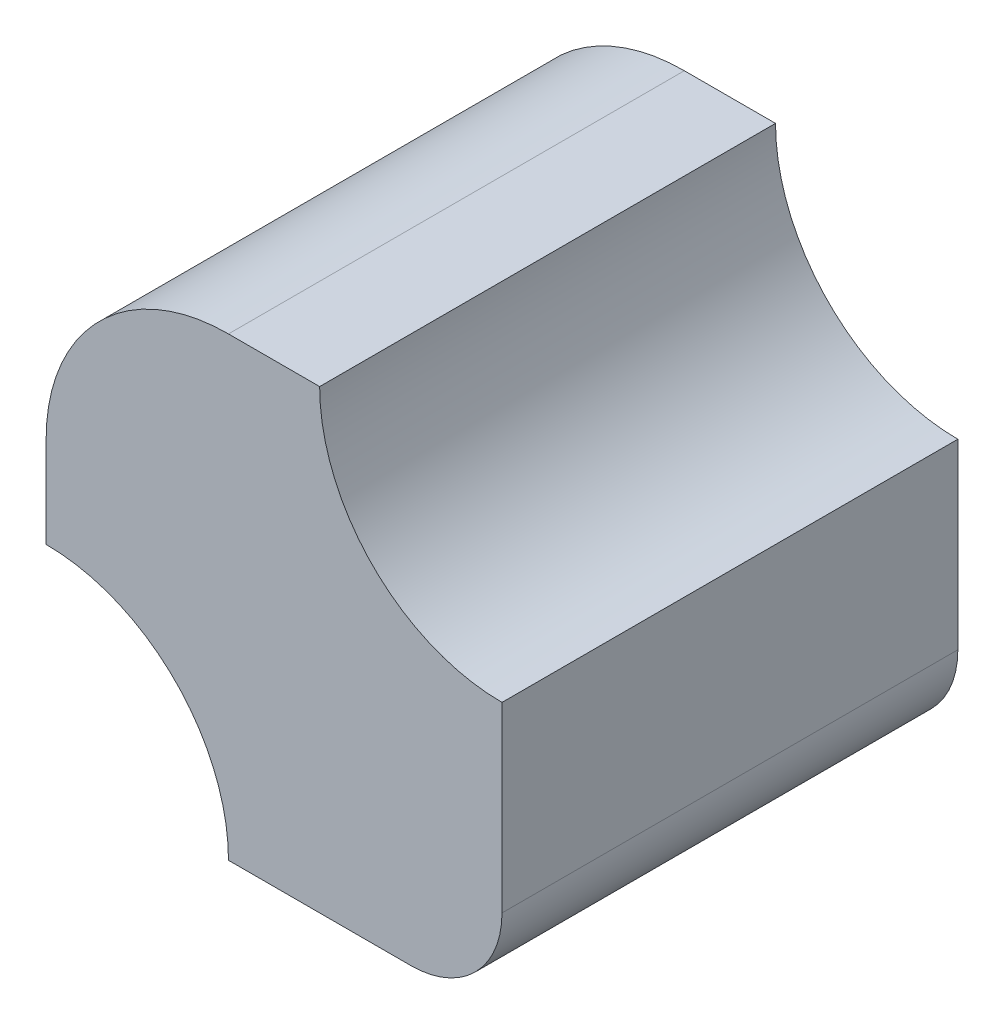
ISO-10303-21;
HEADER;
FILE_DESCRIPTION(('STEP AP214'),'2;1');
FILE_NAME('part.step','',(''),(''),'','','');
FILE_SCHEMA(('AUTOMOTIVE_DESIGN { 1 0 10303 214 1 1 1 1 }'));
ENDSEC;
DATA;
#1=APPLICATION_CONTEXT('core data for automotive mechanical design processes');
#2=APPLICATION_PROTOCOL_DEFINITION('international standard','automotive_design',2000,#1);
#3=PRODUCT_CONTEXT('',#1,'mechanical');
#4=PRODUCT('Part','Part','',(#3));
#5=PRODUCT_RELATED_PRODUCT_CATEGORY('part','',(#4));
#6=PRODUCT_DEFINITION_FORMATION('','',#4);
#7=PRODUCT_DEFINITION_CONTEXT('part definition',#1,'design');
#8=PRODUCT_DEFINITION('design','',#6,#7);
#9=PRODUCT_DEFINITION_SHAPE('','',#8);
#10=(LENGTH_UNIT() NAMED_UNIT(*) SI_UNIT(.MILLI.,.METRE.));
#11=(NAMED_UNIT(*) PLANE_ANGLE_UNIT() SI_UNIT($,.RADIAN.));
#12=(NAMED_UNIT(*) SI_UNIT($,.STERADIAN.) SOLID_ANGLE_UNIT());
#13=UNCERTAINTY_MEASURE_WITH_UNIT(LENGTH_MEASURE(1.E-05),#10,'distance_accuracy_value','');
#14=(GEOMETRIC_REPRESENTATION_CONTEXT(3) GLOBAL_UNCERTAINTY_ASSIGNED_CONTEXT((#13)) GLOBAL_UNIT_ASSIGNED_CONTEXT((#10,
#11,#12)) REPRESENTATION_CONTEXT('',''));
#15=CARTESIAN_POINT('',(0.,0.,0.));
#16=DIRECTION('',(0.,0.,1.));
#17=DIRECTION('',(1.,0.,0.));
#18=AXIS2_PLACEMENT_3D('',#15,#16,#17);
#19=CARTESIAN_POINT('',(-15.,10.,25.));
#20=DIRECTION('',(0.,0.,-1.));
#21=DIRECTION('',(-1.,0.,0.));
#22=AXIS2_PLACEMENT_3D('',#19,#20,#21);
#23=CYLINDRICAL_SURFACE('',#22,10.);
#24=CARTESIAN_POINT('',(-15.,10.,0.));
#25=DIRECTION('',(0.,0.,1.));
#26=DIRECTION('',(-1.,0.,0.));
#27=AXIS2_PLACEMENT_3D('',#24,#25,#26);
#28=CIRCLE('',#27,10.);
#29=CARTESIAN_POINT('',(-15.,20.,0.));
#30=VERTEX_POINT('',#29);
#31=CARTESIAN_POINT('',(-25.,10.,0.));
#32=VERTEX_POINT('',#31);
#33=EDGE_CURVE('E129',#30,#32,#28,.T.);
#34=ORIENTED_EDGE('',*,*,#33,.T.);
#35=DIRECTION('',(0.,0.,-1.));
#36=VECTOR('',#35,1.);
#37=CARTESIAN_POINT('',(-25.,10.,25.));
#38=LINE('',#37,#36);
#39=CARTESIAN_POINT('',(-25.,10.,25.));
#40=VERTEX_POINT('',#39);
#41=EDGE_CURVE('E11',#40,#32,#38,.T.);
#42=ORIENTED_EDGE('',*,*,#41,.F.);
#43=CARTESIAN_POINT('',(-15.,10.,25.));
#44=DIRECTION('',(0.,0.,1.));
#45=DIRECTION('',(-1.,0.,0.));
#46=AXIS2_PLACEMENT_3D('',#43,#44,#45);
#47=CIRCLE('',#46,10.);
#48=CARTESIAN_POINT('',(-15.,20.,25.));
#49=VERTEX_POINT('',#48);
#50=EDGE_CURVE('E143',#49,#40,#47,.T.);
#51=ORIENTED_EDGE('',*,*,#50,.F.);
#52=DIRECTION('',(0.,0.,-1.));
#53=VECTOR('',#52,1.);
#54=CARTESIAN_POINT('',(-15.,20.,25.));
#55=LINE('',#54,#53);
#56=EDGE_CURVE('E125',#49,#30,#55,.T.);
#57=ORIENTED_EDGE('',*,*,#56,.T.);
#58=EDGE_LOOP('',(#34,#42,#51,#57));
#59=FACE_BOUND('',#58,.T.);
#60=ADVANCED_FACE('F33',(#59),#23,.T.);
#61=CARTESIAN_POINT('',(-25.,5.,25.));
#62=DIRECTION('',(1.,0.,0.));
#63=DIRECTION('',(0.,0.,-1.));
#64=AXIS2_PLACEMENT_3D('',#61,#62,#63);
#65=PLANE('',#64);
#66=DIRECTION('',(0.,-1.,0.));
#67=VECTOR('',#66,1.);
#68=CARTESIAN_POINT('',(-25.,5.,0.));
#69=LINE('',#68,#67);
#70=CARTESIAN_POINT('',(-25.,5.,0.));
#71=VERTEX_POINT('',#70);
#72=EDGE_CURVE('E132',#32,#71,#69,.T.);
#73=ORIENTED_EDGE('',*,*,#72,.T.);
#74=DIRECTION('',(0.,0.,-1.));
#75=VECTOR('',#74,1.);
#76=CARTESIAN_POINT('',(-25.,5.,25.));
#77=LINE('',#76,#75);
#78=CARTESIAN_POINT('',(-25.,5.,25.));
#79=VERTEX_POINT('',#78);
#80=EDGE_CURVE('E41',#79,#71,#77,.T.);
#81=ORIENTED_EDGE('',*,*,#80,.F.);
#82=DIRECTION('',(0.,-1.,0.));
#83=VECTOR('',#82,1.);
#84=CARTESIAN_POINT('',(-25.,5.,25.));
#85=LINE('',#84,#83);
#86=EDGE_CURVE('E92',#40,#79,#85,.T.);
#87=ORIENTED_EDGE('',*,*,#86,.F.);
#88=ORIENTED_EDGE('',*,*,#41,.T.);
#89=EDGE_LOOP('',(#73,#81,#87,#88));
#90=FACE_BOUND('',#89,.T.);
#91=ADVANCED_FACE('F178',(#90),#65,.F.);
#92=CARTESIAN_POINT('',(-25.,-5.,25.));
#93=DIRECTION('',(0.,0.,-1.));
#94=DIRECTION('',(-1.,0.,0.));
#95=AXIS2_PLACEMENT_3D('',#92,#93,#94);
#96=CYLINDRICAL_SURFACE('',#95,10.);
#97=CARTESIAN_POINT('',(-25.,-5.,0.));
#98=DIRECTION('',(0.,0.,-1.));
#99=DIRECTION('',(1.,0.,0.));
#100=AXIS2_PLACEMENT_3D('',#97,#98,#99);
#101=CIRCLE('',#100,10.);
#102=CARTESIAN_POINT('',(-15.,-5.,0.));
#103=VERTEX_POINT('',#102);
#104=EDGE_CURVE('E134',#71,#103,#101,.T.);
#105=ORIENTED_EDGE('',*,*,#104,.T.);
#106=DIRECTION('',(0.,0.,-1.));
#107=VECTOR('',#106,1.);
#108=CARTESIAN_POINT('',(-15.,-5.,25.));
#109=LINE('',#108,#107);
#110=CARTESIAN_POINT('',(-15.,-5.,25.));
#111=VERTEX_POINT('',#110);
#112=EDGE_CURVE('E150',#111,#103,#109,.T.);
#113=ORIENTED_EDGE('',*,*,#112,.F.);
#114=CARTESIAN_POINT('',(-25.,-5.,25.));
#115=DIRECTION('',(0.,0.,-1.));
#116=DIRECTION('',(1.,0.,0.));
#117=AXIS2_PLACEMENT_3D('',#114,#115,#116);
#118=CIRCLE('',#117,10.);
#119=EDGE_CURVE('E158',#79,#111,#118,.T.);
#120=ORIENTED_EDGE('',*,*,#119,.F.);
#121=ORIENTED_EDGE('',*,*,#80,.T.);
#122=EDGE_LOOP('',(#105,#113,#120,#121));
#123=FACE_BOUND('',#122,.T.);
#124=ADVANCED_FACE('F156',(#123),#96,.F.);
#125=CARTESIAN_POINT('',(-5.,-5.,25.));
#126=DIRECTION('',(0.,1.,0.));
#127=DIRECTION('',(0.,0.,1.));
#128=AXIS2_PLACEMENT_3D('',#125,#126,#127);
#129=PLANE('',#128);
#130=DIRECTION('',(1.,0.,0.));
#131=VECTOR('',#130,1.);
#132=CARTESIAN_POINT('',(-5.,-5.,0.));
#133=LINE('',#132,#131);
#134=CARTESIAN_POINT('',(-5.,-5.,0.));
#135=VERTEX_POINT('',#134);
#136=EDGE_CURVE('E136',#103,#135,#133,.T.);
#137=ORIENTED_EDGE('',*,*,#136,.T.);
#138=DIRECTION('',(0.,0.,-1.));
#139=VECTOR('',#138,1.);
#140=CARTESIAN_POINT('',(-5.,-5.,25.));
#141=LINE('',#140,#139);
#142=CARTESIAN_POINT('',(-5.,-5.,25.));
#143=VERTEX_POINT('',#142);
#144=EDGE_CURVE('E147',#143,#135,#141,.T.);
#145=ORIENTED_EDGE('',*,*,#144,.F.);
#146=DIRECTION('',(1.,0.,0.));
#147=VECTOR('',#146,1.);
#148=CARTESIAN_POINT('',(-5.,-5.,25.));
#149=LINE('',#148,#147);
#150=EDGE_CURVE('E170',#111,#143,#149,.T.);
#151=ORIENTED_EDGE('',*,*,#150,.F.);
#152=ORIENTED_EDGE('',*,*,#112,.T.);
#153=EDGE_LOOP('',(#137,#145,#151,#152));
#154=FACE_BOUND('',#153,.T.);
#155=ADVANCED_FACE('F166',(#154),#129,.F.);
#156=CARTESIAN_POINT('',(-5.,0.,25.));
#157=DIRECTION('',(0.,0.,-1.));
#158=DIRECTION('',(-1.,0.,0.));
#159=AXIS2_PLACEMENT_3D('',#156,#157,#158);
#160=CYLINDRICAL_SURFACE('',#159,5.);
#161=CARTESIAN_POINT('',(-5.,0.,0.));
#162=DIRECTION('',(0.,0.,1.));
#163=DIRECTION('',(-1.,0.,0.));
#164=AXIS2_PLACEMENT_3D('',#161,#162,#163);
#165=CIRCLE('',#164,5.);
#166=CARTESIAN_POINT('',(0.,0.,0.));
#167=VERTEX_POINT('',#166);
#168=EDGE_CURVE('E138',#135,#167,#165,.T.);
#169=ORIENTED_EDGE('',*,*,#168,.T.);
#170=DIRECTION('',(0.,0.,-1.));
#171=VECTOR('',#170,1.);
#172=CARTESIAN_POINT('',(0.,0.,25.));
#173=LINE('',#172,#171);
#174=CARTESIAN_POINT('',(0.,0.,25.));
#175=VERTEX_POINT('',#174);
#176=EDGE_CURVE('E120',#175,#167,#173,.T.);
#177=ORIENTED_EDGE('',*,*,#176,.F.);
#178=CARTESIAN_POINT('',(-5.,0.,25.));
#179=DIRECTION('',(0.,0.,1.));
#180=DIRECTION('',(-1.,0.,0.));
#181=AXIS2_PLACEMENT_3D('',#178,#179,#180);
#182=CIRCLE('',#181,5.);
#183=EDGE_CURVE('E111',#143,#175,#182,.T.);
#184=ORIENTED_EDGE('',*,*,#183,.F.);
#185=ORIENTED_EDGE('',*,*,#144,.T.);
#186=EDGE_LOOP('',(#169,#177,#184,#185));
#187=FACE_BOUND('',#186,.T.);
#188=ADVANCED_FACE('F169',(#187),#160,.T.);
#189=CARTESIAN_POINT('',(0.,10.,25.));
#190=DIRECTION('',(-1.,0.,0.));
#191=DIRECTION('',(0.,0.,1.));
#192=AXIS2_PLACEMENT_3D('',#189,#190,#191);
#193=PLANE('',#192);
#194=DIRECTION('',(0.,1.,0.));
#195=VECTOR('',#194,1.);
#196=CARTESIAN_POINT('',(0.,10.,0.));
#197=LINE('',#196,#195);
#198=CARTESIAN_POINT('',(0.,10.,0.));
#199=VERTEX_POINT('',#198);
#200=EDGE_CURVE('E119',#167,#199,#197,.T.);
#201=ORIENTED_EDGE('',*,*,#200,.T.);
#202=DIRECTION('',(0.,0.,-1.));
#203=VECTOR('',#202,1.);
#204=CARTESIAN_POINT('',(0.,10.,25.));
#205=LINE('',#204,#203);
#206=CARTESIAN_POINT('',(0.,10.,25.));
#207=VERTEX_POINT('',#206);
#208=EDGE_CURVE('E116',#207,#199,#205,.T.);
#209=ORIENTED_EDGE('',*,*,#208,.F.);
#210=DIRECTION('',(0.,1.,0.));
#211=VECTOR('',#210,1.);
#212=CARTESIAN_POINT('',(0.,10.,25.));
#213=LINE('',#212,#211);
#214=EDGE_CURVE('E105',#175,#207,#213,.T.);
#215=ORIENTED_EDGE('',*,*,#214,.F.);
#216=ORIENTED_EDGE('',*,*,#176,.T.);
#217=EDGE_LOOP('',(#201,#209,#215,#216));
#218=FACE_BOUND('',#217,.T.);
#219=ADVANCED_FACE('F117',(#218),#193,.F.);
#220=CARTESIAN_POINT('',(0.,20.,25.));
#221=DIRECTION('',(0.,0.,-1.));
#222=DIRECTION('',(-1.,0.,0.));
#223=AXIS2_PLACEMENT_3D('',#220,#221,#222);
#224=CYLINDRICAL_SURFACE('',#223,10.);
#225=CARTESIAN_POINT('',(0.,20.,0.));
#226=DIRECTION('',(0.,0.,-1.));
#227=DIRECTION('',(1.,0.,0.));
#228=AXIS2_PLACEMENT_3D('',#225,#226,#227);
#229=CIRCLE('',#228,10.);
#230=CARTESIAN_POINT('',(-10.,20.,0.));
#231=VERTEX_POINT('',#230);
#232=EDGE_CURVE('E78',#199,#231,#229,.T.);
#233=ORIENTED_EDGE('',*,*,#232,.T.);
#234=DIRECTION('',(0.,0.,-1.));
#235=VECTOR('',#234,1.);
#236=CARTESIAN_POINT('',(-10.,20.,25.));
#237=LINE('',#236,#235);
#238=CARTESIAN_POINT('',(-10.,20.,25.));
#239=VERTEX_POINT('',#238);
#240=EDGE_CURVE('E121',#239,#231,#237,.T.);
#241=ORIENTED_EDGE('',*,*,#240,.F.);
#242=CARTESIAN_POINT('',(0.,20.,25.));
#243=DIRECTION('',(0.,0.,-1.));
#244=DIRECTION('',(1.,0.,0.));
#245=AXIS2_PLACEMENT_3D('',#242,#243,#244);
#246=CIRCLE('',#245,10.);
#247=EDGE_CURVE('E109',#207,#239,#246,.T.);
#248=ORIENTED_EDGE('',*,*,#247,.F.);
#249=ORIENTED_EDGE('',*,*,#208,.T.);
#250=EDGE_LOOP('',(#233,#241,#248,#249));
#251=FACE_BOUND('',#250,.T.);
#252=ADVANCED_FACE('F123',(#251),#224,.F.);
#253=CARTESIAN_POINT('',(-15.,20.,25.));
#254=DIRECTION('',(0.,-1.,0.));
#255=DIRECTION('',(0.,0.,-1.));
#256=AXIS2_PLACEMENT_3D('',#253,#254,#255);
#257=PLANE('',#256);
#258=DIRECTION('',(-1.,0.,0.));
#259=VECTOR('',#258,1.);
#260=CARTESIAN_POINT('',(-15.,20.,0.));
#261=LINE('',#260,#259);
#262=EDGE_CURVE('E84',#231,#30,#261,.T.);
#263=ORIENTED_EDGE('',*,*,#262,.T.);
#264=ORIENTED_EDGE('',*,*,#56,.F.);
#265=DIRECTION('',(-1.,0.,0.));
#266=VECTOR('',#265,1.);
#267=CARTESIAN_POINT('',(-15.,20.,25.));
#268=LINE('',#267,#266);
#269=EDGE_CURVE('E49',#239,#49,#268,.T.);
#270=ORIENTED_EDGE('',*,*,#269,.F.);
#271=ORIENTED_EDGE('',*,*,#240,.T.);
#272=EDGE_LOOP('',(#263,#264,#270,#271));
#273=FACE_BOUND('',#272,.T.);
#274=ADVANCED_FACE('F194',(#273),#257,.F.);
#275=CARTESIAN_POINT('',(-15.,10.,25.));
#276=DIRECTION('',(0.,0.,-1.));
#277=DIRECTION('',(-1.,0.,0.));
#278=AXIS2_PLACEMENT_3D('',#275,#276,#277);
#279=PLANE('',#278);
#280=ORIENTED_EDGE('',*,*,#50,.T.);
#281=ORIENTED_EDGE('',*,*,#86,.T.);
#282=ORIENTED_EDGE('',*,*,#119,.T.);
#283=ORIENTED_EDGE('',*,*,#150,.T.);
#284=ORIENTED_EDGE('',*,*,#183,.T.);
#285=ORIENTED_EDGE('',*,*,#214,.T.);
#286=ORIENTED_EDGE('',*,*,#247,.T.);
#287=ORIENTED_EDGE('',*,*,#269,.T.);
#288=EDGE_LOOP('',(#280,#281,#282,#283,#284,#285,#286,#287));
#289=FACE_BOUND('',#288,.T.);
#290=ADVANCED_FACE('F107',(#289),#279,.F.);
#291=CARTESIAN_POINT('',(-15.,10.,0.));
#292=DIRECTION('',(0.,0.,-1.));
#293=DIRECTION('',(-1.,0.,0.));
#294=AXIS2_PLACEMENT_3D('',#291,#292,#293);
#295=PLANE('',#294);
#296=ORIENTED_EDGE('',*,*,#33,.F.);
#297=ORIENTED_EDGE('',*,*,#262,.F.);
#298=ORIENTED_EDGE('',*,*,#232,.F.);
#299=ORIENTED_EDGE('',*,*,#200,.F.);
#300=ORIENTED_EDGE('',*,*,#168,.F.);
#301=ORIENTED_EDGE('',*,*,#136,.F.);
#302=ORIENTED_EDGE('',*,*,#104,.F.);
#303=ORIENTED_EDGE('',*,*,#72,.F.);
#304=EDGE_LOOP('',(#296,#297,#298,#299,#300,#301,#302,#303));
#305=FACE_BOUND('',#304,.T.);
#306=ADVANCED_FACE('F162',(#305),#295,.T.);
#307=CLOSED_SHELL('',(#60,#91,#124,#155,#188,#219,#252,#274,#290,#306));
#308=MANIFOLD_SOLID_BREP('B2',#307);
#309=ADVANCED_BREP_SHAPE_REPRESENTATION('',(#18,#308),#14);
#310=SHAPE_DEFINITION_REPRESENTATION(#9,#309);
ENDSEC;
END-ISO-10303-21;
